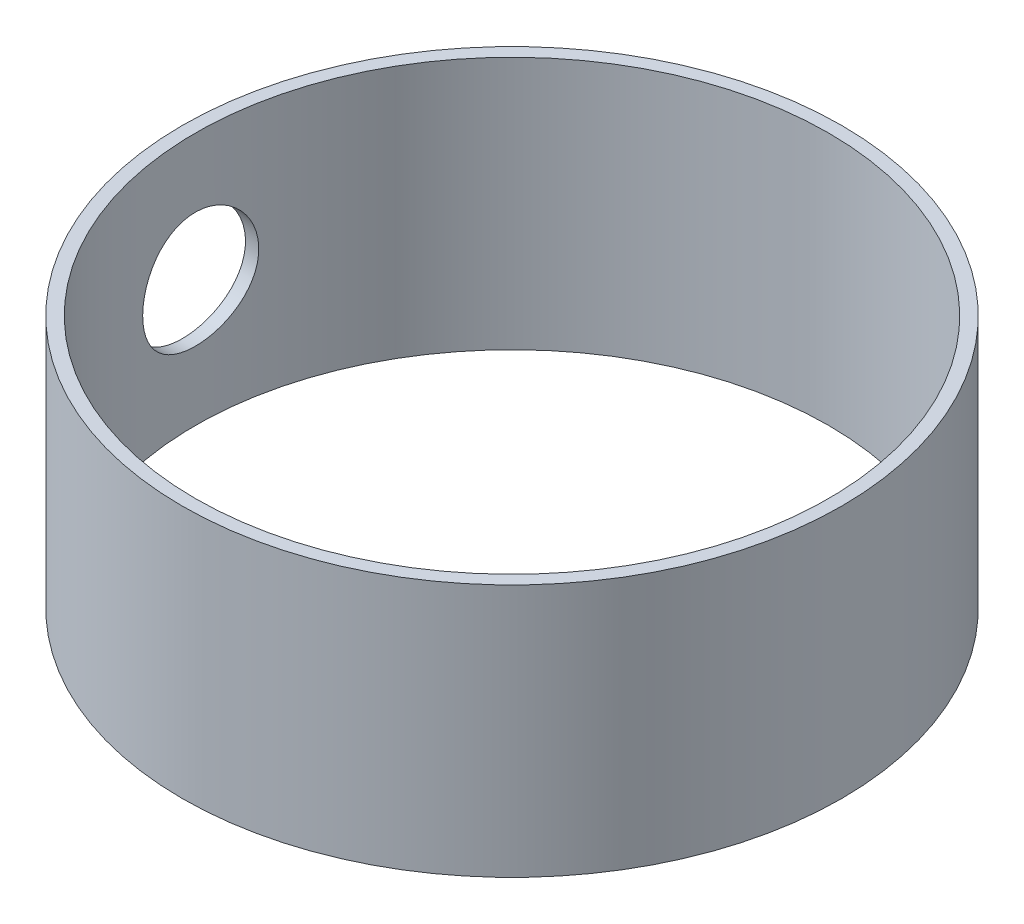
ISO-10303-21;
HEADER;
FILE_DESCRIPTION(('STEP AP214'),'2;1');
FILE_NAME('part.step','',(''),(''),'','','');
FILE_SCHEMA(('AUTOMOTIVE_DESIGN { 1 0 10303 214 1 1 1 1 }'));
ENDSEC;
DATA;
#1=APPLICATION_CONTEXT('core data for automotive mechanical design processes');
#2=APPLICATION_PROTOCOL_DEFINITION('international standard','automotive_design',2000,#1);
#3=PRODUCT_CONTEXT('',#1,'mechanical');
#4=PRODUCT('Part','Part','',(#3));
#5=PRODUCT_RELATED_PRODUCT_CATEGORY('part','',(#4));
#6=PRODUCT_DEFINITION_FORMATION('','',#4);
#7=PRODUCT_DEFINITION_CONTEXT('part definition',#1,'design');
#8=PRODUCT_DEFINITION('design','',#6,#7);
#9=PRODUCT_DEFINITION_SHAPE('','',#8);
#10=(LENGTH_UNIT() NAMED_UNIT(*) SI_UNIT(.MILLI.,.METRE.));
#11=(NAMED_UNIT(*) PLANE_ANGLE_UNIT() SI_UNIT($,.RADIAN.));
#12=(NAMED_UNIT(*) SI_UNIT($,.STERADIAN.) SOLID_ANGLE_UNIT());
#13=UNCERTAINTY_MEASURE_WITH_UNIT(LENGTH_MEASURE(1.E-05),#10,'distance_accuracy_value','');
#14=(GEOMETRIC_REPRESENTATION_CONTEXT(3) GLOBAL_UNCERTAINTY_ASSIGNED_CONTEXT((#13)) GLOBAL_UNIT_ASSIGNED_CONTEXT((#10,
#11,#12)) REPRESENTATION_CONTEXT('',''));
#15=CARTESIAN_POINT('',(0.,0.,0.));
#16=DIRECTION('',(0.,0.,1.));
#17=DIRECTION('',(1.,0.,0.));
#18=AXIS2_PLACEMENT_3D('',#15,#16,#17);
#19=CARTESIAN_POINT('',(0.,15.24,0.));
#20=DIRECTION('',(0.,1.,0.));
#21=DIRECTION('',(0.,0.,1.));
#22=AXIS2_PLACEMENT_3D('',#19,#20,#21);
#23=PLANE('',#22);
#24=CARTESIAN_POINT('',(0.,15.24,0.));
#25=DIRECTION('',(0.,1.,0.));
#26=DIRECTION('',(0.,0.,1.));
#27=AXIS2_PLACEMENT_3D('',#24,#25,#26);
#28=CIRCLE('',#27,39.6748);
#29=CARTESIAN_POINT('',(0.,15.24,39.6748));
#30=VERTEX_POINT('',#29);
#31=EDGE_CURVE('E10',#30,#30,#28,.T.);
#32=ORIENTED_EDGE('',*,*,#31,.T.);
#33=EDGE_LOOP('',(#32));
#34=FACE_BOUND('',#33,.T.);
#35=CARTESIAN_POINT('',(0.,15.24,0.));
#36=DIRECTION('',(0.,1.,0.));
#37=DIRECTION('',(0.,0.,1.));
#38=AXIS2_PLACEMENT_3D('',#35,#36,#37);
#39=CIRCLE('',#38,38.1);
#40=CARTESIAN_POINT('',(0.,15.24,38.1));
#41=VERTEX_POINT('',#40);
#42=EDGE_CURVE('E61',#41,#41,#39,.T.);
#43=ORIENTED_EDGE('',*,*,#42,.F.);
#44=EDGE_LOOP('',(#43));
#45=FACE_BOUND('',#44,.T.);
#46=ADVANCED_FACE('F38',(#34,#45),#23,.T.);
#47=CARTESIAN_POINT('',(0.,-15.24,0.));
#48=DIRECTION('',(0.,1.,0.));
#49=DIRECTION('',(0.,0.,1.));
#50=AXIS2_PLACEMENT_3D('',#47,#48,#49);
#51=PLANE('',#50);
#52=CARTESIAN_POINT('',(0.,-15.24,0.));
#53=DIRECTION('',(0.,1.,0.));
#54=DIRECTION('',(0.,0.,1.));
#55=AXIS2_PLACEMENT_3D('',#52,#53,#54);
#56=CIRCLE('',#55,39.6748);
#57=CARTESIAN_POINT('',(0.,-15.24,39.6748));
#58=VERTEX_POINT('',#57);
#59=EDGE_CURVE('E53',#58,#58,#56,.T.);
#60=ORIENTED_EDGE('',*,*,#59,.F.);
#61=EDGE_LOOP('',(#60));
#62=FACE_BOUND('',#61,.T.);
#63=CARTESIAN_POINT('',(0.,-15.24,0.));
#64=DIRECTION('',(0.,1.,0.));
#65=DIRECTION('',(0.,0.,1.));
#66=AXIS2_PLACEMENT_3D('',#63,#64,#65);
#67=CIRCLE('',#66,38.1);
#68=CARTESIAN_POINT('',(0.,-15.24,38.1));
#69=VERTEX_POINT('',#68);
#70=EDGE_CURVE('E63',#69,#69,#67,.T.);
#71=ORIENTED_EDGE('',*,*,#70,.T.);
#72=EDGE_LOOP('',(#71));
#73=FACE_BOUND('',#72,.T.);
#74=ADVANCED_FACE('F85',(#62,#73),#51,.F.);
#75=CARTESIAN_POINT('',(0.,15.24,0.));
#76=DIRECTION('',(0.,-1.,0.));
#77=DIRECTION('',(0.,0.,-1.));
#78=AXIS2_PLACEMENT_3D('',#75,#76,#77);
#79=CYLINDRICAL_SURFACE('',#78,39.6748);
#80=CARTESIAN_POINT('',(-39.0550832804131,0.,6.985));
#81=CARTESIAN_POINT('',(-39.0550817265756,-0.194603597274686,6.9850032262089));
#82=CARTESIAN_POINT('',(-39.0565405823278,-0.389164503736028,6.97686502492429));
#83=CARTESIAN_POINT('',(-39.0623299400837,-0.776945062351789,6.94438091334581));
#84=CARTESIAN_POINT('',(-39.0666609891602,-0.970164451898485,6.92003191534238));
#85=CARTESIAN_POINT('',(-39.0780734517395,-1.35392692124256,6.85529019749161));
#86=CARTESIAN_POINT('',(-39.0851565245731,-1.544468314387,6.8148877979227));
#87=CARTESIAN_POINT('',(-39.101868689623,-1.92147912961888,6.71833459436009));
#88=CARTESIAN_POINT('',(-39.1114987172426,-2.10794702836611,6.66217800396652));
#89=CARTESIAN_POINT('',(-39.1330111445267,-2.47519636749988,6.53462830170002));
#90=CARTESIAN_POINT('',(-39.1448906926123,-2.65598467289521,6.46325446552442));
#91=CARTESIAN_POINT('',(-39.1705748928618,-3.0109395116131,6.30572631965745));
#92=CARTESIAN_POINT('',(-39.1843802543936,-3.18510357469203,6.2195665609076));
#93=CARTESIAN_POINT('',(-39.213514762499,-3.5254718775543,6.03315057073288));
#94=CARTESIAN_POINT('',(-39.2288431732651,-3.69167990405853,5.93290113662593));
#95=CARTESIAN_POINT('',(-39.2606059816314,-4.01516825092359,5.71893955580344));
#96=CARTESIAN_POINT('',(-39.2770407899522,-4.17244521547806,5.60522239752778));
#97=CARTESIAN_POINT('',(-39.3107139345522,-4.47839720740171,5.36399948649026));
#98=CARTESIAN_POINT('',(-39.3279584083282,-4.62697662320438,5.2363733073016));
#99=CARTESIAN_POINT('',(-39.3626263198416,-4.91293976563526,4.96906128900494));
#100=CARTESIAN_POINT('',(-39.3800498214942,-5.05031932548199,4.82937100102339));
#101=CARTESIAN_POINT('',(-39.4145769554567,-5.31284084277191,4.53896990496719));
#102=CARTESIAN_POINT('',(-39.4316806835189,-5.4379865125537,4.3882624644294));
#103=CARTESIAN_POINT('',(-39.4651028295597,-5.67526362202379,4.07675799930835));
#104=CARTESIAN_POINT('',(-39.4814209557367,-5.78739024745706,3.91595727602299));
#105=CARTESIAN_POINT('',(-39.5129119574376,-5.99847046618073,3.5843353088248));
#106=CARTESIAN_POINT('',(-39.5280766726481,-6.097333409183,3.41345556921855));
#107=CARTESIAN_POINT('',(-39.556712110551,-6.28029547203761,3.06382806505089));
#108=CARTESIAN_POINT('',(-39.5701828208125,-6.36439448355071,2.88508024276471));
#109=CARTESIAN_POINT('',(-39.5950456545913,-6.51719235069499,2.52099232725679));
#110=CARTESIAN_POINT('',(-39.6064379204565,-6.58589226104955,2.33565268653348));
#111=CARTESIAN_POINT('',(-39.626819069063,-6.70737268805802,1.95969444644982));
#112=CARTESIAN_POINT('',(-39.6358079228383,-6.76015301285014,1.76907578349727));
#113=CARTESIAN_POINT('',(-39.6510431899126,-6.84891159033439,1.38596224128694));
#114=CARTESIAN_POINT('',(-39.657317307616,-6.88505982997796,1.19350784764865));
#115=CARTESIAN_POINT('',(-39.6670834080593,-6.94109034784005,0.806109933123803));
#116=CARTESIAN_POINT('',(-39.6705744297812,-6.96096700745782,0.61116557602762));
#117=CARTESIAN_POINT('',(-39.6746688138671,-6.98426533980777,0.220335960836599));
#118=CARTESIAN_POINT('',(-39.6752734135737,-6.98769406339415,0.0244511419507562));
#119=CARTESIAN_POINT('',(-39.6735875322167,-6.97810749589549,-0.366922829331423));
#120=CARTESIAN_POINT('',(-39.6712959865751,-6.96508615802412,-0.562411809761561));
#121=CARTESIAN_POINT('',(-39.6602263956465,-6.90189418102656,-1.14168576534509));
#122=CARTESIAN_POINT('',(-39.6473009205479,-6.82787268206177,-1.52307965169549));
#123=CARTESIAN_POINT('',(-39.611697003913,-6.61796800562452,-2.2677340100377));
#124=CARTESIAN_POINT('',(-39.5890182390399,-6.48208277726388,-2.63099388041287));
#125=CARTESIAN_POINT('',(-39.5362505764827,-6.15160412543832,-3.33146015798139));
#126=CARTESIAN_POINT('',(-39.5061248434579,-5.95671775060139,-3.66852576204662));
#127=CARTESIAN_POINT('',(-39.441801825589,-5.51398428161329,-4.30542525986136));
#128=CARTESIAN_POINT('',(-39.4076041742452,-5.26613241861874,-4.60525579723838));
#129=CARTESIAN_POINT('',(-39.3383882388882,-4.72051915345722,-5.16345533410292));
#130=CARTESIAN_POINT('',(-39.3033651120023,-4.42212783293085,-5.42120845534904));
#131=CARTESIAN_POINT('',(-39.2368906446044,-3.78601775839117,-5.88309364392939));
#132=CARTESIAN_POINT('',(-39.2054393448848,-3.44829855531697,-6.08722509890416));
#133=CARTESIAN_POINT('',(-39.1496650175655,-2.74236047561212,-6.43621855650403));
#134=CARTESIAN_POINT('',(-39.1253517249757,-2.37410081629485,-6.58099972117271));
#135=CARTESIAN_POINT('',(-39.0867617125192,-1.61796233857195,-6.80646948604671));
#136=CARTESIAN_POINT('',(-39.0724839993735,-1.2300854658694,-6.88716442933656));
#137=CARTESIAN_POINT('',(-39.0557758733481,-0.451252799013677,-6.98129002721882));
#138=CARTESIAN_POINT('',(-39.0531902969104,-0.0604067063427059,-6.99560170441718));
#139=CARTESIAN_POINT('',(-39.0597450725372,0.718093464123329,-6.95890825221153));
#140=CARTESIAN_POINT('',(-39.0688849166717,1.10574767945431,-6.90790595212489));
#141=CARTESIAN_POINT('',(-39.0977168209863,1.86401874342483,-6.74278614730726));
#142=CARTESIAN_POINT('',(-39.1173328972305,2.23473766489482,-6.62912293207325));
#143=CARTESIAN_POINT('',(-39.1648425638908,2.95186764070295,-6.34238528427646));
#144=CARTESIAN_POINT('',(-39.192736700409,3.298277089485,-6.16930693199024));
#145=CARTESIAN_POINT('',(-39.254016814351,3.96085724952546,-5.76660042933415));
#146=CARTESIAN_POINT('',(-39.2874561143145,4.2766819089785,-5.53641123910674));
#147=CARTESIAN_POINT('',(-39.3559058835333,4.86554244413409,-5.02676223647265));
#148=CARTESIAN_POINT('',(-39.3909164764891,5.13857494338194,-4.74729853982415));
#149=CARTESIAN_POINT('',(-39.459056724794,5.63733175612663,-4.1431883619391));
#150=CARTESIAN_POINT('',(-39.4921596292184,5.86246615595553,-3.81805219434493));
#151=CARTESIAN_POINT('',(-39.5523226589257,6.25496178802607,-3.1338425143336));
#152=CARTESIAN_POINT('',(-39.579382996605,6.42232505103853,-2.77477019540524));
#153=CARTESIAN_POINT('',(-39.6130908891808,6.62583974312506,-2.21974565396472));
#154=CARTESIAN_POINT('',(-39.6231673463653,6.68568874367215,-2.03236561554761));
#155=CARTESIAN_POINT('',(-39.6407974822245,6.78939938813146,-1.65313297892396));
#156=CARTESIAN_POINT('',(-39.6483520732124,6.83326681408242,-1.46128202504967));
#157=CARTESIAN_POINT('',(-39.6607205052872,6.9046687327357,-1.07446774906046));
#158=CARTESIAN_POINT('',(-39.6655340326612,6.93220135594578,-0.879504073320591));
#159=CARTESIAN_POINT('',(-39.6722830785587,6.97071574130742,-0.487900836520094));
#160=CARTESIAN_POINT('',(-39.674218692726,6.98169805348732,-0.291261331371931));
#161=CARTESIAN_POINT('',(-39.6751498563079,6.98698724705968,0.0995898844836644));
#162=CARTESIAN_POINT('',(-39.6741847458264,6.98151725655915,0.293798530875053));
#163=CARTESIAN_POINT('',(-39.6694268030571,6.95442811718822,0.681048400688321));
#164=CARTESIAN_POINT('',(-39.6656340210739,6.93280925560805,0.87408964481683));
#165=CARTESIAN_POINT('',(-39.6553256833616,6.87358521456007,1.25766356218625));
#166=CARTESIAN_POINT('',(-39.6488096547517,6.83597725863092,1.44819579381723));
#167=CARTESIAN_POINT('',(-39.6332389452728,6.74507977159899,1.82530232689145));
#168=CARTESIAN_POINT('',(-39.6241851771781,6.69179587847795,2.01187802551467));
#169=CARTESIAN_POINT('',(-39.6037992632796,6.57000635002137,2.3796480977619));
#170=CARTESIAN_POINT('',(-39.5924694900545,6.50151655803265,2.56084785154062));
#171=CARTESIAN_POINT('',(-39.5678415569606,6.34981508125011,2.9167588431324));
#172=CARTESIAN_POINT('',(-39.5545441008233,6.26660865771255,3.09147237287923));
#173=CARTESIAN_POINT('',(-39.5263355930291,6.08601911703434,3.43336379861132));
#174=CARTESIAN_POINT('',(-39.5114239027916,5.98863038416533,3.60053867503553));
#175=CARTESIAN_POINT('',(-39.4804029339052,5.78042169499148,3.92610155563878));
#176=CARTESIAN_POINT('',(-39.464294074821,5.66960643570118,4.08449260456838));
#177=CARTESIAN_POINT('',(-39.4310954424768,5.43374301878364,4.3935105365224));
#178=CARTESIAN_POINT('',(-39.4139955905265,5.3085275659075,4.54400867331301));
#179=CARTESIAN_POINT('',(-39.3794933921908,5.0459780192722,4.83389696125163));
#180=CARTESIAN_POINT('',(-39.362091155533,4.90864825066669,4.97329104330673));
#181=CARTESIAN_POINT('',(-39.3274533446555,4.62268394809736,5.24016119038498));
#182=CARTESIAN_POINT('',(-39.3102178764577,4.47404269498536,5.36763006989903));
#183=CARTESIAN_POINT('',(-39.2764143162963,4.16659612650173,5.60963100750401));
#184=CARTESIAN_POINT('',(-39.2598459807907,4.00779457605384,5.72416781460739));
#185=CARTESIAN_POINT('',(-39.2277036053854,3.67968365939592,5.94046167156083));
#186=CARTESIAN_POINT('',(-39.2121390860984,3.51029723584885,6.04210329588068));
#187=CARTESIAN_POINT('',(-39.1826149038049,3.16348227645632,6.23069455240003));
#188=CARTESIAN_POINT('',(-39.1686546506569,2.98605673156626,6.31764959273524));
#189=CARTESIAN_POINT('',(-39.1427501331046,2.62446900886937,6.47621225364965));
#190=CARTESIAN_POINT('',(-39.1308045112156,2.44031146979403,6.54783021739999));
#191=CARTESIAN_POINT('',(-39.1092729712474,2.06652825299085,6.67522902420644));
#192=CARTESIAN_POINT('',(-39.0996865591824,1.87690372927907,6.73101318301729));
#193=CARTESIAN_POINT('',(-39.0795665251115,1.41008978477603,6.84705398795595));
#194=CARTESIAN_POINT('',(-39.0704316062848,1.13065732935534,6.89871977378304));
#195=CARTESIAN_POINT('',(-39.0581911822979,0.567452946699269,6.96769005322724));
#196=CARTESIAN_POINT('',(-39.0550855455015,0.283681114341023,6.98499529703177));
#197=CARTESIAN_POINT('',(-39.0550832804131,0.,6.985));
#198=B_SPLINE_CURVE_WITH_KNOTS('',3,(#80,#81,#82,#83,#84,#85,#86,#87,#88,#89,#90,#91,#92,#93,
#94,#95,#96,#97,#98,#99,#100,#101,#102,#103,#104,#105,#106,#107,#108,#109,#110,#111,#112,#113,
#114,#115,#116,#117,#118,#119,#120,#121,#122,#123,#124,#125,#126,#127,#128,#129,#130,#131,#132,
#133,#134,#135,#136,#137,#138,#139,#140,#141,#142,#143,#144,#145,#146,#147,#148,#149,#150,#151,
#152,#153,#154,#155,#156,#157,#158,#159,#160,#161,#162,#163,#164,#165,#166,#167,#168,#169,#170,
#171,#172,#173,#174,#175,#176,#177,#178,#179,#180,#181,#182,#183,#184,#185,#186,#187,#188,#189,
#190,#191,#192,#193,#194,#195,#196,#197),.UNSPECIFIED.,.T.,.F.,(4,2,2,2,2,2,2,2,2,2,2,2,2,2,2,2,
2,2,2,2,2,2,2,2,2,2,2,2,2,2,2,2,2,2,2,2,2,2,2,2,2,2,2,2,2,2,2,2,2,2,2,2,2,2,2,2,2,2,4),(0.,
0.583561860606642,1.16723490546166,1.75126042310316,2.33550073055052,2.91900533112775,
3.50272543436524,4.0861648925346,4.66982214427647,5.25900897268656,5.84841401055492,
6.43763963634604,7.02708245999888,7.62036827247462,8.21365843836063,8.8069079558779,
9.40016462291341,9.9872153695488,10.5744687402761,11.1614703463975,11.7486877879611,
12.9088771194908,14.0691049160775,15.2351906569893,16.4013814328051,17.5833511552719,
18.765334375247,19.9489222065981,21.1323928749541,22.3001109939328,23.4677785305779,
24.6270897747101,25.7864775153929,26.95773997865,28.1290948122343,29.3141333897699,
30.4991303065901,31.0894340457665,31.679524003967,32.269681484005,32.859819350485,
33.441989947984,34.02415018885,34.6064115615233,35.188463774511,35.7699123575841,
36.3511534890249,36.9326254018262,37.5138944819171,38.1027710710681,38.6914382590181,
39.280457893103,39.8692605145909,40.4630088319163,41.0565380305117,41.6496656895792,
42.2426690500801,43.093368089897,43.9440485563538),.UNSPECIFIED.);
#199=CARTESIAN_POINT('',(-39.0550832804131,0.,6.985));
#200=VERTEX_POINT('',#199);
#201=EDGE_CURVE('E67',#200,#200,#198,.T.);
#202=ORIENTED_EDGE('',*,*,#201,.T.);
#203=EDGE_LOOP('',(#202));
#204=FACE_BOUND('',#203,.T.);
#205=ORIENTED_EDGE('',*,*,#31,.F.);
#206=EDGE_LOOP('',(#205));
#207=FACE_BOUND('',#206,.T.);
#208=ORIENTED_EDGE('',*,*,#59,.T.);
#209=EDGE_LOOP('',(#208));
#210=FACE_BOUND('',#209,.T.);
#211=ADVANCED_FACE('F40',(#204,#207,#210),#79,.T.);
#212=CARTESIAN_POINT('',(0.,15.24,0.));
#213=DIRECTION('',(0.,-1.,0.));
#214=DIRECTION('',(0.,0.,-1.));
#215=AXIS2_PLACEMENT_3D('',#212,#213,#214);
#216=CYLINDRICAL_SURFACE('',#215,38.1);
#217=CARTESIAN_POINT('',(-37.4542357417689,0.,6.985));
#218=CARTESIAN_POINT('',(-37.4542340335856,-0.194464365119095,6.98500341044482));
#219=CARTESIAN_POINT('',(-37.4557531297054,-0.388884365059366,6.97687674833693));
#220=CARTESIAN_POINT('',(-37.4617811721207,-0.776382062742376,6.94443978947506));
#221=CARTESIAN_POINT('',(-37.4662906694423,-0.96945950647218,6.9201265100915));
#222=CARTESIAN_POINT('',(-37.478172796642,-1.35293241786612,6.85548221590612));
#223=CARTESIAN_POINT('',(-37.4855470853783,-1.54332626527868,6.81514192034917));
#224=CARTESIAN_POINT('',(-37.5029455269161,-1.92004265287763,6.71874058764855));
#225=CARTESIAN_POINT('',(-37.5129706537791,-2.10636366918238,6.66267377126899));
#226=CARTESIAN_POINT('',(-37.5353642245376,-2.47331623761358,6.53533486680276));
#227=CARTESIAN_POINT('',(-37.5477296183793,-2.65395484215529,6.46408255479551));
#228=CARTESIAN_POINT('',(-37.5744630618756,-3.00861816777117,6.30682841163832));
#229=CARTESIAN_POINT('',(-37.5888318496007,-3.18264042110627,6.22082114191044));
#230=CARTESIAN_POINT('',(-37.6191546451127,-3.5227404457298,6.03473953227077));
#231=CARTESIAN_POINT('',(-37.6351079050101,-3.68882191083844,5.93467181989021));
#232=CARTESIAN_POINT('',(-37.6681651718401,-4.01207648425703,5.7211020246111));
#233=CARTESIAN_POINT('',(-37.6852696064969,-4.16924624097017,5.60759493622383));
#234=CARTESIAN_POINT('',(-37.7203297592619,-4.47513449053522,5.36671988244961));
#235=CARTESIAN_POINT('',(-37.7382924312327,-4.62374925530996,5.23922118616095));
#236=CARTESIAN_POINT('',(-37.7744057534238,-4.90979610472508,4.97216524633305));
#237=CARTESIAN_POINT('',(-37.7925564708134,-5.04722402648908,4.83260355335284));
#238=CARTESIAN_POINT('',(-37.8285269375006,-5.30985836992188,4.54245613913192));
#239=CARTESIAN_POINT('',(-37.8463467850673,-5.43506846888959,4.39187375890616));
#240=CARTESIAN_POINT('',(-37.8811712736579,-5.67249162946864,4.08061163007768));
#241=CARTESIAN_POINT('',(-37.8981756117912,-5.7846998836066,3.91992818023198));
#242=CARTESIAN_POINT('',(-37.9310043474684,-5.99602309546371,3.58843169489784));
#243=CARTESIAN_POINT('',(-37.9468194993777,-6.09503932207421,3.41755477941641));
#244=CARTESIAN_POINT('',(-37.9766865903169,-6.27830610064407,3.06790765977002));
#245=CARTESIAN_POINT('',(-37.9907385176212,-6.3625565544126,2.88913740312505));
#246=CARTESIAN_POINT('',(-38.0166778327587,-6.5156514041885,2.52497930929047));
#247=CARTESIAN_POINT('',(-38.0285653776832,-6.58449691837195,2.33959195354004));
#248=CARTESIAN_POINT('',(-38.0498368374673,-6.70625865120083,1.96351348205738));
#249=CARTESIAN_POINT('',(-38.0592207246134,-6.75917469352029,1.77282230764183));
#250=CARTESIAN_POINT('',(-38.0751238291354,-6.84815130467234,1.38970582942301));
#251=CARTESIAN_POINT('',(-38.081674237376,-6.88439569168576,1.19732451239956));
#252=CARTESIAN_POINT('',(-38.0918803115573,-6.94062917693157,0.810058707322744));
#253=CARTESIAN_POINT('',(-38.0955349778411,-6.96061266170201,0.615173378417279));
#254=CARTESIAN_POINT('',(-38.0998391012048,-6.98413298069271,0.224450938984988));
#255=CARTESIAN_POINT('',(-38.1004898630556,-6.98767695555416,0.0286142786867387));
#256=CARTESIAN_POINT('',(-38.0987778829125,-6.97832837815022,-0.362672760191964));
#257=CARTESIAN_POINT('',(-38.0964140331955,-6.96542978404094,-0.558122970334553));
#258=CARTESIAN_POINT('',(-38.0849617863367,-6.90265340469178,-1.13692982699056));
#259=CARTESIAN_POINT('',(-38.0715664562845,-6.82899586505117,-1.51791104494491));
#260=CARTESIAN_POINT('',(-38.0346342605489,-6.6199701739879,-2.26179959193676));
#261=CARTESIAN_POINT('',(-38.0110970374096,-6.48459984745923,-2.62470628342607));
#262=CARTESIAN_POINT('',(-37.9562951129605,-6.15524073563332,-3.32469145626117));
#263=CARTESIAN_POINT('',(-37.9249892013956,-5.96093807148118,-3.66161921308304));
#264=CARTESIAN_POINT('',(-37.8581135431649,-5.51946094265874,-4.29836436034081));
#265=CARTESIAN_POINT('',(-37.8225433814101,-5.27228132901796,-4.59817813225636));
#266=CARTESIAN_POINT('',(-37.7504673261026,-4.72776156727665,-5.1568243540644));
#267=CARTESIAN_POINT('',(-37.7139553598422,-4.42973897361676,-5.4149913338823));
#268=CARTESIAN_POINT('',(-37.6446105303586,-3.79427178313642,-5.87777391971749));
#269=CARTESIAN_POINT('',(-37.6117777164019,-3.45682665854391,-6.08238880868334));
#270=CARTESIAN_POINT('',(-37.5535009560369,-2.7512340406458,-6.43243770481418));
#271=CARTESIAN_POINT('',(-37.528068668238,-2.38303926677213,-6.57777847603568));
#272=CARTESIAN_POINT('',(-37.4876537243386,-1.62688668233034,-6.80435117102317));
#273=CARTESIAN_POINT('',(-37.4726699401927,-1.2389310100503,-6.88559001551088));
#274=CARTESIAN_POINT('',(-37.455070721655,-0.460260921402858,-6.98068846629739));
#275=CARTESIAN_POINT('',(-37.4522800715632,-0.0696669325942429,-6.99550267847477));
#276=CARTESIAN_POINT('',(-37.4589146767246,0.708414626111016,-6.9598870110048));
#277=CARTESIAN_POINT('',(-37.4683393558095,1.09590234165586,-6.90946020862243));
#278=CARTESIAN_POINT('',(-37.4981797480304,1.8536558197193,-6.74561267808338));
#279=CARTESIAN_POINT('',(-37.5185086394037,2.22403285797792,-6.63268933847961));
#280=CARTESIAN_POINT('',(-37.567792546678,2.94060901145865,-6.34757931682255));
#281=CARTESIAN_POINT('',(-37.5967481738298,3.2868064112764,-6.1753884352096));
#282=CARTESIAN_POINT('',(-37.6604235753204,3.94940919419028,-5.77442755388588));
#283=CARTESIAN_POINT('',(-37.695203570055,4.2654426499109,-5.54505274003571));
#284=CARTESIAN_POINT('',(-37.7664385352839,4.85488241001963,-5.03703452095225));
#285=CARTESIAN_POINT('',(-37.8028936492712,5.12828505375178,-4.75838688910141));
#286=CARTESIAN_POINT('',(-37.8739308661826,5.62823306698939,-4.1555485188003));
#287=CARTESIAN_POINT('',(-37.908483202911,5.85413734744883,-3.83082296491046));
#288=CARTESIAN_POINT('',(-37.9713324109234,6.24823091361036,-3.14725574581758));
#289=CARTESIAN_POINT('',(-37.9996295154769,6.41642235166244,-2.78841535353515));
#290=CARTESIAN_POINT('',(-38.0349216614478,6.62116650405889,-2.23364848592047));
#291=CARTESIAN_POINT('',(-38.0454793436149,6.68141688280223,-2.04636875526318));
#292=CARTESIAN_POINT('',(-38.0639729117851,6.78593707367533,-1.66729216906996));
#293=CARTESIAN_POINT('',(-38.0719097493761,6.83021268653555,-1.47549698018324));
#294=CARTESIAN_POINT('',(-38.0849325342111,6.90243187281752,-1.08875211294535));
#295=CARTESIAN_POINT('',(-38.0900181727629,6.93037367783197,-0.893802095378593));
#296=CARTESIAN_POINT('',(-38.0971934628091,6.96970246595735,-0.502186155801179));
#297=CARTESIAN_POINT('',(-38.0992832165704,6.98109001416135,-0.30552029259287));
#298=CARTESIAN_POINT('',(-38.1003983111704,6.98717276230741,0.0851950602812863));
#299=CARTESIAN_POINT('',(-38.0994680560968,6.98210983750537,0.279240713867854));
#300=CARTESIAN_POINT('',(-38.0946665212248,6.95586146347478,0.666198873364099));
#301=CARTESIAN_POINT('',(-38.090795294647,6.93467630599918,0.859111399715539));
#302=CARTESIAN_POINT('',(-38.0802188116775,6.87634429275332,1.24246182581909));
#303=CARTESIAN_POINT('',(-38.0735130690796,6.83919469857619,1.43289929524415));
#304=CARTESIAN_POINT('',(-38.0574567584225,6.74923666334752,1.80985156272998));
#305=CARTESIAN_POINT('',(-38.0481071396432,6.69643384223586,1.9963677429475));
#306=CARTESIAN_POINT('',(-38.0270339709624,6.57564191901225,2.36401125976491));
#307=CARTESIAN_POINT('',(-38.0153134686137,6.50767230097484,2.54514517539167));
#308=CARTESIAN_POINT('',(-37.9898170066066,6.35703751144827,2.90096733230064));
#309=CARTESIAN_POINT('',(-37.9760417799685,6.27437757870546,3.07565784465057));
#310=CARTESIAN_POINT('',(-37.9468021908692,6.09490439601373,3.41755117988409));
#311=CARTESIAN_POINT('',(-37.9313371522119,5.9980854749134,3.58475096726045));
#312=CARTESIAN_POINT('',(-37.8991479363645,5.79103530536336,3.91041622446112));
#313=CARTESIAN_POINT('',(-37.8824241981316,5.68080872449747,4.06888470614301));
#314=CARTESIAN_POINT('',(-37.84792345255,5.44602630643407,4.3782715941428));
#315=CARTESIAN_POINT('',(-37.8301349213764,5.32129038761438,4.52905208934449));
#316=CARTESIAN_POINT('',(-37.7942242408193,5.05968252905636,4.81954680608308));
#317=CARTESIAN_POINT('',(-37.7761022118906,4.92281490550728,4.95926493013614));
#318=CARTESIAN_POINT('',(-37.7400122156101,4.63775193041014,5.22682665540353));
#319=CARTESIAN_POINT('',(-37.7220443469253,4.48954985015857,5.35466310173461));
#320=CARTESIAN_POINT('',(-37.6867838719834,4.18295113589211,5.5974429355429));
#321=CARTESIAN_POINT('',(-37.6694910195735,4.02455827493742,5.71239105208562));
#322=CARTESIAN_POINT('',(-37.6359081775295,3.69710283582493,5.92963853380613));
#323=CARTESIAN_POINT('',(-37.6196288528839,3.52795564959226,6.03181208086623));
#324=CARTESIAN_POINT('',(-37.5887265833075,3.18156202441505,6.22148431584865));
#325=CARTESIAN_POINT('',(-37.5741030291187,3.00431859847903,6.30898840728381));
#326=CARTESIAN_POINT('',(-37.5469436812541,2.64303112500576,6.46866165555624));
#327=CARTESIAN_POINT('',(-37.5344065205077,2.45899162784654,6.54084086236056));
#328=CARTESIAN_POINT('',(-37.5117821927866,2.08538295794792,6.66936578317037));
#329=CARTESIAN_POINT('',(-37.5016945241731,1.89581492633567,6.72571473947115));
#330=CARTESIAN_POINT('',(-37.4803486169003,1.42608504230964,6.8438746666799));
#331=CARTESIAN_POINT('',(-37.4706070159754,1.14354998687372,6.8967292106066));
#332=CARTESIAN_POINT('',(-37.4575519194361,0.573977681042483,6.9672889194405));
#333=CARTESIAN_POINT('',(-37.4542382622669,0.286940543981634,6.98499496774183));
#334=CARTESIAN_POINT('',(-37.4542357417689,0.,6.985));
#335=B_SPLINE_CURVE_WITH_KNOTS('',3,(#217,#218,#219,#220,#221,#222,#223,#224,#225,#226,#227,
#228,#229,#230,#231,#232,#233,#234,#235,#236,#237,#238,#239,#240,#241,#242,#243,#244,#245,#246,
#247,#248,#249,#250,#251,#252,#253,#254,#255,#256,#257,#258,#259,#260,#261,#262,#263,#264,#265,
#266,#267,#268,#269,#270,#271,#272,#273,#274,#275,#276,#277,#278,#279,#280,#281,#282,#283,#284,
#285,#286,#287,#288,#289,#290,#291,#292,#293,#294,#295,#296,#297,#298,#299,#300,#301,#302,#303,
#304,#305,#306,#307,#308,#309,#310,#311,#312,#313,#314,#315,#316,#317,#318,#319,#320,#321,#322,
#323,#324,#325,#326,#327,#328,#329,#330,#331,#332,#333,#334),.UNSPECIFIED.,.T.,.F.,(4,2,2,2,2,2,
2,2,2,2,2,2,2,2,2,2,2,2,2,2,2,2,2,2,2,2,2,2,2,2,2,2,2,2,2,2,2,2,2,2,2,2,2,2,2,2,2,2,2,2,2,2,2,2,
2,2,2,2,4),(0.,0.58314118016331,1.16638984268,1.74997674008899,2.33377837761672,
2.91682432567043,3.50008564408908,4.08307295298481,4.66627808230467,5.25549051982041,
5.84492122365616,6.43417397089884,7.02364390561281,7.61730358335934,8.21096720873075,
8.80458772871014,9.39821481933209,9.98512982282328,10.5722473506848,11.159109835151,
11.7461880251918,12.9050114787165,14.063875778861,15.2290240333359,16.3942857975185,
17.5766361341406,18.75900230138,19.9432211785347,21.1273121847886,22.2943306055198,
23.4612939827478,24.6191007441661,25.7769895619633,26.9476870898476,28.1184850888106,
29.3041936605191,30.4898580074556,31.0803169492355,31.6705612682489,32.2608694792305,
32.8511575390868,33.4328059479824,34.0144438314379,34.5961815240742,35.1777106092764,
35.7584968887695,36.3390764668386,36.9198892267195,37.5005003649296,38.0892957014909,
38.6778823922633,39.2668212511857,39.8555433009119,40.4496704423673,41.0435782531633,
41.6370953714944,42.2304908389991,43.0909623859047,43.9514123061339),.UNSPECIFIED.);
#336=CARTESIAN_POINT('',(-37.4542357417689,0.,6.985));
#337=VERTEX_POINT('',#336);
#338=EDGE_CURVE('E43',#337,#337,#335,.T.);
#339=ORIENTED_EDGE('',*,*,#338,.F.);
#340=EDGE_LOOP('',(#339));
#341=FACE_BOUND('',#340,.T.);
#342=ORIENTED_EDGE('',*,*,#42,.T.);
#343=EDGE_LOOP('',(#342));
#344=FACE_BOUND('',#343,.T.);
#345=ORIENTED_EDGE('',*,*,#70,.F.);
#346=EDGE_LOOP('',(#345));
#347=FACE_BOUND('',#346,.T.);
#348=ADVANCED_FACE('F77',(#341,#344,#347),#216,.F.);
#349=CARTESIAN_POINT('',(-33.3248,0.,0.));
#350=DIRECTION('',(-1.,0.,0.));
#351=DIRECTION('',(0.,0.,1.));
#352=AXIS2_PLACEMENT_3D('',#349,#350,#351);
#353=CYLINDRICAL_SURFACE('',#352,6.985);
#354=ORIENTED_EDGE('',*,*,#338,.T.);
#355=EDGE_LOOP('',(#354));
#356=FACE_BOUND('',#355,.T.);
#357=ORIENTED_EDGE('',*,*,#201,.F.);
#358=EDGE_LOOP('',(#357));
#359=FACE_BOUND('',#358,.T.);
#360=ADVANCED_FACE('F74',(#356,#359),#353,.F.);
#361=CLOSED_SHELL('',(#46,#74,#211,#348,#360));
#362=MANIFOLD_SOLID_BREP('B2',#361);
#363=ADVANCED_BREP_SHAPE_REPRESENTATION('',(#18,#362),#14);
#364=SHAPE_DEFINITION_REPRESENTATION(#9,#363);
ENDSEC;
END-ISO-10303-21;
